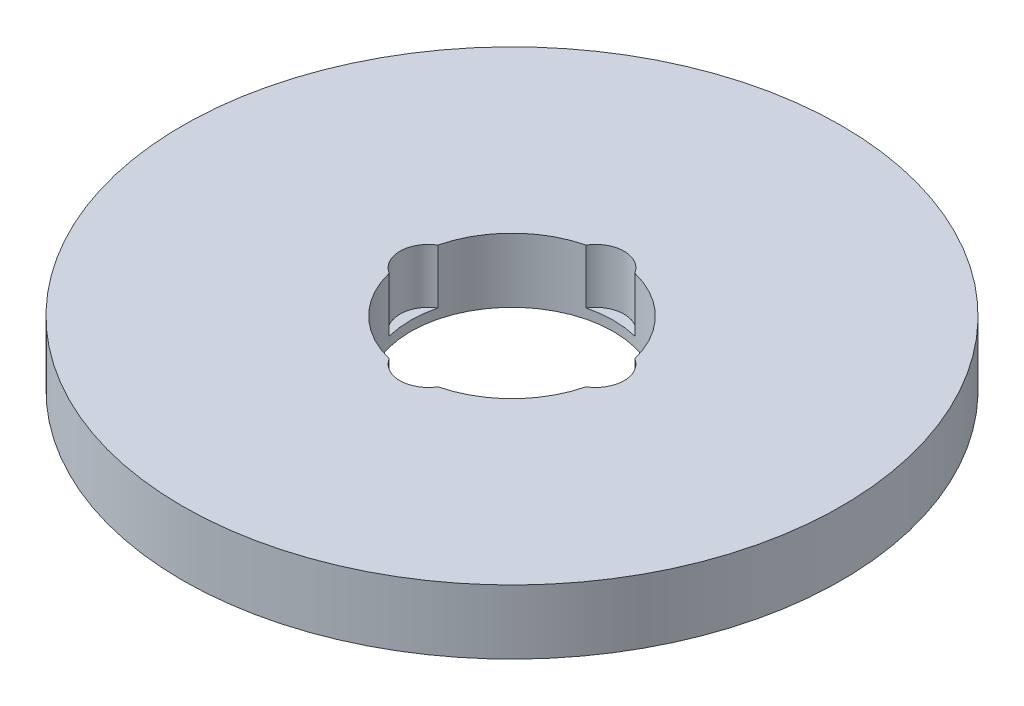
ISO-10303-21;
HEADER;
FILE_DESCRIPTION(('STEP AP214'),'2;1');
FILE_NAME('part.step','',(''),(''),'','','');
FILE_SCHEMA(('AUTOMOTIVE_DESIGN { 1 0 10303 214 1 1 1 1 }'));
ENDSEC;
DATA;
#1=APPLICATION_CONTEXT('core data for automotive mechanical design processes');
#2=APPLICATION_PROTOCOL_DEFINITION('international standard','automotive_design',2000,#1);
#3=PRODUCT_CONTEXT('',#1,'mechanical');
#4=PRODUCT('Part','Part','',(#3));
#5=PRODUCT_RELATED_PRODUCT_CATEGORY('part','',(#4));
#6=PRODUCT_DEFINITION_FORMATION('','',#4);
#7=PRODUCT_DEFINITION_CONTEXT('part definition',#1,'design');
#8=PRODUCT_DEFINITION('design','',#6,#7);
#9=PRODUCT_DEFINITION_SHAPE('','',#8);
#10=(LENGTH_UNIT() NAMED_UNIT(*) SI_UNIT(.MILLI.,.METRE.));
#11=(NAMED_UNIT(*) PLANE_ANGLE_UNIT() SI_UNIT($,.RADIAN.));
#12=(NAMED_UNIT(*) SI_UNIT($,.STERADIAN.) SOLID_ANGLE_UNIT());
#13=UNCERTAINTY_MEASURE_WITH_UNIT(LENGTH_MEASURE(1.E-05),#10,'distance_accuracy_value','');
#14=(GEOMETRIC_REPRESENTATION_CONTEXT(3) GLOBAL_UNCERTAINTY_ASSIGNED_CONTEXT((#13)) GLOBAL_UNIT_ASSIGNED_CONTEXT((#10,
#11,#12)) REPRESENTATION_CONTEXT('',''));
#15=CARTESIAN_POINT('',(0.,0.,0.));
#16=DIRECTION('',(0.,0.,1.));
#17=DIRECTION('',(1.,0.,0.));
#18=AXIS2_PLACEMENT_3D('',#15,#16,#17);
#19=CARTESIAN_POINT('',(0.,19.,0.));
#20=DIRECTION('',(0.,-1.,0.));
#21=DIRECTION('',(0.,0.,-1.));
#22=AXIS2_PLACEMENT_3D('',#19,#20,#21);
#23=CYLINDRICAL_SURFACE('',#22,97.5);
#24=CARTESIAN_POINT('',(0.,19.,0.));
#25=DIRECTION('',(0.,1.,0.));
#26=DIRECTION('',(0.,0.,1.));
#27=AXIS2_PLACEMENT_3D('',#24,#25,#26);
#28=CIRCLE('',#27,97.5);
#29=CARTESIAN_POINT('',(0.,19.,97.5));
#30=VERTEX_POINT('',#29);
#31=EDGE_CURVE('E148',#30,#30,#28,.T.);
#32=ORIENTED_EDGE('',*,*,#31,.F.);
#33=EDGE_LOOP('',(#32));
#34=FACE_BOUND('',#33,.T.);
#35=CARTESIAN_POINT('',(0.,0.,0.));
#36=DIRECTION('',(0.,1.,0.));
#37=DIRECTION('',(0.,0.,1.));
#38=AXIS2_PLACEMENT_3D('',#35,#36,#37);
#39=CIRCLE('',#38,97.5);
#40=CARTESIAN_POINT('',(0.,0.,97.5));
#41=VERTEX_POINT('',#40);
#42=EDGE_CURVE('E139',#41,#41,#39,.T.);
#43=ORIENTED_EDGE('',*,*,#42,.T.);
#44=EDGE_LOOP('',(#43));
#45=FACE_BOUND('',#44,.T.);
#46=ADVANCED_FACE('F39',(#34,#45),#23,.T.);
#47=CARTESIAN_POINT('',(0.,19.,0.));
#48=DIRECTION('',(0.,1.,0.));
#49=DIRECTION('',(0.,0.,1.));
#50=AXIS2_PLACEMENT_3D('',#47,#48,#49);
#51=PLANE('',#50);
#52=CARTESIAN_POINT('',(0.,19.,24.7238429751527));
#53=DIRECTION('',(0.,1.,0.));
#54=DIRECTION('',(1.,0.,0.));
#55=AXIS2_PLACEMENT_3D('',#52,#53,#54);
#56=CIRCLE('',#55,8.44103843737079);
#57=CARTESIAN_POINT('',(-7.20465332845952,19.,29.1220358219805));
#58=VERTEX_POINT('',#57);
#59=CARTESIAN_POINT('',(7.20465332845973,19.,29.1220358219805));
#60=VERTEX_POINT('',#59);
#61=EDGE_CURVE('E175',#58,#60,#56,.T.);
#62=ORIENTED_EDGE('',*,*,#61,.F.);
#63=CARTESIAN_POINT('',(0.,19.,0.));
#64=DIRECTION('',(0.,1.,0.));
#65=DIRECTION('',(0.,0.,1.));
#66=AXIS2_PLACEMENT_3D('',#63,#64,#65);
#67=CIRCLE('',#66,30.);
#68=CARTESIAN_POINT('',(-29.1220358219805,19.,7.20465332845963));
#69=VERTEX_POINT('',#68);
#70=EDGE_CURVE('E134',#69,#58,#67,.T.);
#71=ORIENTED_EDGE('',*,*,#70,.F.);
#72=CARTESIAN_POINT('',(-24.7238429751527,19.,0.));
#73=DIRECTION('',(0.,1.,0.));
#74=DIRECTION('',(0.,0.,1.));
#75=AXIS2_PLACEMENT_3D('',#72,#73,#74);
#76=CIRCLE('',#75,8.44103843737079);
#77=CARTESIAN_POINT('',(-29.1220358219805,19.,-7.20465332845963));
#78=VERTEX_POINT('',#77);
#79=EDGE_CURVE('E143',#78,#69,#76,.T.);
#80=ORIENTED_EDGE('',*,*,#79,.F.);
#81=CARTESIAN_POINT('',(-7.20465332845993,19.,-29.1220358219804));
#82=VERTEX_POINT('',#81);
#83=EDGE_CURVE('E123',#82,#78,#67,.T.);
#84=ORIENTED_EDGE('',*,*,#83,.F.);
#85=CARTESIAN_POINT('',(-2.58968509116701E-13,19.,-24.7238429751527));
#86=DIRECTION('',(0.,1.,0.));
#87=DIRECTION('',(-1.,0.,0.));
#88=AXIS2_PLACEMENT_3D('',#85,#86,#87);
#89=CIRCLE('',#88,8.44103843737079);
#90=CARTESIAN_POINT('',(7.20465332845932,19.,-29.1220358219806));
#91=VERTEX_POINT('',#90);
#92=EDGE_CURVE('E106',#91,#82,#89,.T.);
#93=ORIENTED_EDGE('',*,*,#92,.F.);
#94=CARTESIAN_POINT('',(29.1220358219805,19.,-7.20465332845963));
#95=VERTEX_POINT('',#94);
#96=EDGE_CURVE('E125',#95,#91,#67,.T.);
#97=ORIENTED_EDGE('',*,*,#96,.F.);
#98=CARTESIAN_POINT('',(24.7238429751527,19.,0.));
#99=DIRECTION('',(0.,1.,0.));
#100=DIRECTION('',(0.,0.,-1.));
#101=AXIS2_PLACEMENT_3D('',#98,#99,#100);
#102=CIRCLE('',#101,8.44103843737079);
#103=CARTESIAN_POINT('',(29.1220358219805,19.,7.20465332845963));
#104=VERTEX_POINT('',#103);
#105=EDGE_CURVE('E286',#104,#95,#102,.T.);
#106=ORIENTED_EDGE('',*,*,#105,.F.);
#107=EDGE_CURVE('E135',#60,#104,#67,.T.);
#108=ORIENTED_EDGE('',*,*,#107,.F.);
#109=EDGE_LOOP('',(#62,#71,#80,#84,#93,#97,#106,#108));
#110=FACE_BOUND('',#109,.T.);
#111=ORIENTED_EDGE('',*,*,#31,.T.);
#112=EDGE_LOOP('',(#111));
#113=FACE_BOUND('',#112,.T.);
#114=ADVANCED_FACE('F118',(#110,#113),#51,.T.);
#115=CARTESIAN_POINT('',(0.,0.,0.));
#116=DIRECTION('',(0.,1.,0.));
#117=DIRECTION('',(0.,0.,1.));
#118=AXIS2_PLACEMENT_3D('',#115,#116,#117);
#119=PLANE('',#118);
#120=CARTESIAN_POINT('',(0.,0.,0.));
#121=DIRECTION('',(0.,1.,0.));
#122=DIRECTION('',(0.,0.,1.));
#123=AXIS2_PLACEMENT_3D('',#120,#121,#122);
#124=CIRCLE('',#123,30.);
#125=CARTESIAN_POINT('',(0.,0.,30.));
#126=VERTEX_POINT('',#125);
#127=EDGE_CURVE('E136',#126,#126,#124,.T.);
#128=ORIENTED_EDGE('',*,*,#127,.T.);
#129=EDGE_LOOP('',(#128));
#130=FACE_BOUND('',#129,.T.);
#131=ORIENTED_EDGE('',*,*,#42,.F.);
#132=EDGE_LOOP('',(#131));
#133=FACE_BOUND('',#132,.T.);
#134=ADVANCED_FACE('F187',(#130,#133),#119,.F.);
#135=CARTESIAN_POINT('',(0.,19.,0.));
#136=DIRECTION('',(0.,-1.,0.));
#137=DIRECTION('',(0.,0.,-1.));
#138=AXIS2_PLACEMENT_3D('',#135,#136,#137);
#139=CYLINDRICAL_SURFACE('',#138,30.);
#140=DIRECTION('',(0.,1.,0.));
#141=VECTOR('',#140,1.);
#142=CARTESIAN_POINT('',(-7.20465332845952,10.9364369538742,29.1220358219805));
#143=LINE('',#142,#141);
#144=CARTESIAN_POINT('',(-7.20465332845952,2.87287390774831,29.1220358219805));
#145=VERTEX_POINT('',#144);
#146=EDGE_CURVE('E11',#145,#58,#143,.T.);
#147=ORIENTED_EDGE('',*,*,#146,.F.);
#148=CARTESIAN_POINT('',(0.,2.87287390774831,0.));
#149=DIRECTION('',(0.,1.,0.));
#150=DIRECTION('',(0.,0.,1.));
#151=AXIS2_PLACEMENT_3D('',#148,#149,#150);
#152=CIRCLE('',#151,30.);
#153=CARTESIAN_POINT('',(7.20465332845973,2.87287390774831,29.1220358219805));
#154=VERTEX_POINT('',#153);
#155=EDGE_CURVE('E170',#145,#154,#152,.T.);
#156=ORIENTED_EDGE('',*,*,#155,.T.);
#157=DIRECTION('',(0.,1.,0.));
#158=VECTOR('',#157,1.);
#159=CARTESIAN_POINT('',(7.20465332845973,10.9364369538742,29.1220358219805));
#160=LINE('',#159,#158);
#161=EDGE_CURVE('E46',#60,#154,#160,.F.);
#162=ORIENTED_EDGE('',*,*,#161,.F.);
#163=ORIENTED_EDGE('',*,*,#107,.T.);
#164=DIRECTION('',(0.,1.,0.));
#165=VECTOR('',#164,1.);
#166=CARTESIAN_POINT('',(29.1220358219805,10.9364369538742,7.20465332845963));
#167=LINE('',#166,#165);
#168=CARTESIAN_POINT('',(29.1220358219805,2.87287390774831,7.20465332845963));
#169=VERTEX_POINT('',#168);
#170=EDGE_CURVE('E164',#169,#104,#167,.T.);
#171=ORIENTED_EDGE('',*,*,#170,.F.);
#172=CARTESIAN_POINT('',(0.,2.87287390774831,0.));
#173=DIRECTION('',(0.,1.,0.));
#174=DIRECTION('',(0.,0.,1.));
#175=AXIS2_PLACEMENT_3D('',#172,#173,#174);
#176=CIRCLE('',#175,30.);
#177=CARTESIAN_POINT('',(29.1220358219805,2.87287390774831,-7.20465332845963));
#178=VERTEX_POINT('',#177);
#179=EDGE_CURVE('E115',#169,#178,#176,.T.);
#180=ORIENTED_EDGE('',*,*,#179,.T.);
#181=DIRECTION('',(0.,1.,0.));
#182=VECTOR('',#181,1.);
#183=CARTESIAN_POINT('',(29.1220358219805,10.9364369538742,-7.20465332845963));
#184=LINE('',#183,#182);
#185=EDGE_CURVE('E131',#95,#178,#184,.F.);
#186=ORIENTED_EDGE('',*,*,#185,.F.);
#187=ORIENTED_EDGE('',*,*,#96,.T.);
#188=DIRECTION('',(0.,1.,0.));
#189=VECTOR('',#188,1.);
#190=CARTESIAN_POINT('',(7.20465332845932,10.9364369538742,-29.1220358219806));
#191=LINE('',#190,#189);
#192=CARTESIAN_POINT('',(7.20465332845932,2.87287390774831,-29.1220358219806));
#193=VERTEX_POINT('',#192);
#194=EDGE_CURVE('E105',#193,#91,#191,.T.);
#195=ORIENTED_EDGE('',*,*,#194,.F.);
#196=CARTESIAN_POINT('',(0.,2.87287390774831,0.));
#197=DIRECTION('',(0.,1.,0.));
#198=DIRECTION('',(0.,0.,1.));
#199=AXIS2_PLACEMENT_3D('',#196,#197,#198);
#200=CIRCLE('',#199,30.);
#201=CARTESIAN_POINT('',(-7.20465332845993,2.87287390774831,-29.1220358219804));
#202=VERTEX_POINT('',#201);
#203=EDGE_CURVE('E159',#193,#202,#200,.T.);
#204=ORIENTED_EDGE('',*,*,#203,.T.);
#205=DIRECTION('',(0.,1.,0.));
#206=VECTOR('',#205,1.);
#207=CARTESIAN_POINT('',(-7.20465332845993,10.9364369538742,-29.1220358219804));
#208=LINE('',#207,#206);
#209=EDGE_CURVE('E114',#82,#202,#208,.F.);
#210=ORIENTED_EDGE('',*,*,#209,.F.);
#211=ORIENTED_EDGE('',*,*,#83,.T.);
#212=DIRECTION('',(0.,1.,0.));
#213=VECTOR('',#212,1.);
#214=CARTESIAN_POINT('',(-29.1220358219805,10.9364369538742,-7.20465332845963));
#215=LINE('',#214,#213);
#216=CARTESIAN_POINT('',(-29.1220358219805,2.87287390774831,-7.20465332845963));
#217=VERTEX_POINT('',#216);
#218=EDGE_CURVE('E160',#217,#78,#215,.T.);
#219=ORIENTED_EDGE('',*,*,#218,.F.);
#220=CARTESIAN_POINT('',(0.,2.87287390774831,0.));
#221=DIRECTION('',(0.,1.,0.));
#222=DIRECTION('',(0.,0.,1.));
#223=AXIS2_PLACEMENT_3D('',#220,#221,#222);
#224=CIRCLE('',#223,30.);
#225=CARTESIAN_POINT('',(-29.1220358219805,2.87287390774831,7.20465332845963));
#226=VERTEX_POINT('',#225);
#227=EDGE_CURVE('E149',#217,#226,#224,.T.);
#228=ORIENTED_EDGE('',*,*,#227,.T.);
#229=DIRECTION('',(0.,1.,0.));
#230=VECTOR('',#229,1.);
#231=CARTESIAN_POINT('',(-29.1220358219805,10.9364369538742,7.20465332845963));
#232=LINE('',#231,#230);
#233=EDGE_CURVE('E152',#69,#226,#232,.F.);
#234=ORIENTED_EDGE('',*,*,#233,.F.);
#235=ORIENTED_EDGE('',*,*,#70,.T.);
#236=EDGE_LOOP('',(#147,#156,#162,#163,#171,#180,#186,#187,#195,#204,#210,#211,#219,#228,#234,#235));
#237=FACE_BOUND('',#236,.T.);
#238=ORIENTED_EDGE('',*,*,#127,.F.);
#239=EDGE_LOOP('',(#238));
#240=FACE_BOUND('',#239,.T.);
#241=ADVANCED_FACE('F126',(#237,#240),#139,.F.);
#242=CARTESIAN_POINT('',(-24.7238429751527,2.87287390774831,0.));
#243=DIRECTION('',(0.,1.,0.));
#244=DIRECTION('',(0.,0.,1.));
#245=AXIS2_PLACEMENT_3D('',#242,#243,#244);
#246=CYLINDRICAL_SURFACE('',#245,8.44103843737079);
#247=ORIENTED_EDGE('',*,*,#218,.T.);
#248=ORIENTED_EDGE('',*,*,#79,.T.);
#249=ORIENTED_EDGE('',*,*,#233,.T.);
#250=CARTESIAN_POINT('',(-24.7238429751527,2.87287390774831,0.));
#251=DIRECTION('',(0.,1.,0.));
#252=DIRECTION('',(0.,0.,1.));
#253=AXIS2_PLACEMENT_3D('',#250,#251,#252);
#254=CIRCLE('',#253,8.44103843737079);
#255=EDGE_CURVE('E144',#217,#226,#254,.T.);
#256=ORIENTED_EDGE('',*,*,#255,.F.);
#257=EDGE_LOOP('',(#247,#248,#249,#256));
#258=FACE_BOUND('',#257,.T.);
#259=ADVANCED_FACE('F200',(#258),#246,.F.);
#260=CARTESIAN_POINT('',(-24.7238429751527,2.87287390774831,0.));
#261=DIRECTION('',(0.,1.,0.));
#262=DIRECTION('',(0.,0.,1.));
#263=AXIS2_PLACEMENT_3D('',#260,#261,#262);
#264=PLANE('',#263);
#265=ORIENTED_EDGE('',*,*,#255,.T.);
#266=ORIENTED_EDGE('',*,*,#227,.F.);
#267=EDGE_LOOP('',(#265,#266));
#268=FACE_BOUND('',#267,.T.);
#269=ADVANCED_FACE('F201',(#268),#264,.T.);
#270=CARTESIAN_POINT('',(-2.58968509116701E-13,2.87287390774831,-24.7238429751527));
#271=DIRECTION('',(0.,1.,0.));
#272=DIRECTION('',(0.,0.,1.));
#273=AXIS2_PLACEMENT_3D('',#270,#271,#272);
#274=CYLINDRICAL_SURFACE('',#273,8.44103843737079);
#275=ORIENTED_EDGE('',*,*,#194,.T.);
#276=ORIENTED_EDGE('',*,*,#92,.T.);
#277=ORIENTED_EDGE('',*,*,#209,.T.);
#278=CARTESIAN_POINT('',(-2.58968509116701E-13,2.87287390774831,-24.7238429751527));
#279=DIRECTION('',(0.,1.,0.));
#280=DIRECTION('',(-1.,0.,0.));
#281=AXIS2_PLACEMENT_3D('',#278,#279,#280);
#282=CIRCLE('',#281,8.44103843737079);
#283=EDGE_CURVE('E107',#193,#202,#282,.T.);
#284=ORIENTED_EDGE('',*,*,#283,.F.);
#285=EDGE_LOOP('',(#275,#276,#277,#284));
#286=FACE_BOUND('',#285,.T.);
#287=ADVANCED_FACE('F102',(#286),#274,.F.);
#288=CARTESIAN_POINT('',(-2.58968509116701E-13,2.87287390774831,-24.7238429751527));
#289=DIRECTION('',(0.,1.,0.));
#290=DIRECTION('',(-1.,0.,0.));
#291=AXIS2_PLACEMENT_3D('',#288,#289,#290);
#292=PLANE('',#291);
#293=ORIENTED_EDGE('',*,*,#283,.T.);
#294=ORIENTED_EDGE('',*,*,#203,.F.);
#295=EDGE_LOOP('',(#293,#294));
#296=FACE_BOUND('',#295,.T.);
#297=ADVANCED_FACE('F209',(#296),#292,.T.);
#298=CARTESIAN_POINT('',(24.7238429751527,2.87287390774831,0.));
#299=DIRECTION('',(0.,1.,0.));
#300=DIRECTION('',(0.,0.,1.));
#301=AXIS2_PLACEMENT_3D('',#298,#299,#300);
#302=CYLINDRICAL_SURFACE('',#301,8.44103843737079);
#303=ORIENTED_EDGE('',*,*,#170,.T.);
#304=ORIENTED_EDGE('',*,*,#105,.T.);
#305=ORIENTED_EDGE('',*,*,#185,.T.);
#306=CARTESIAN_POINT('',(24.7238429751527,2.87287390774831,0.));
#307=DIRECTION('',(0.,1.,0.));
#308=DIRECTION('',(0.,0.,-1.));
#309=AXIS2_PLACEMENT_3D('',#306,#307,#308);
#310=CIRCLE('',#309,8.44103843737079);
#311=EDGE_CURVE('E56',#169,#178,#310,.T.);
#312=ORIENTED_EDGE('',*,*,#311,.F.);
#313=EDGE_LOOP('',(#303,#304,#305,#312));
#314=FACE_BOUND('',#313,.T.);
#315=ADVANCED_FACE('F213',(#314),#302,.F.);
#316=CARTESIAN_POINT('',(24.7238429751527,2.87287390774831,0.));
#317=DIRECTION('',(0.,1.,0.));
#318=DIRECTION('',(0.,0.,-1.));
#319=AXIS2_PLACEMENT_3D('',#316,#317,#318);
#320=PLANE('',#319);
#321=ORIENTED_EDGE('',*,*,#311,.T.);
#322=ORIENTED_EDGE('',*,*,#179,.F.);
#323=EDGE_LOOP('',(#321,#322));
#324=FACE_BOUND('',#323,.T.);
#325=ADVANCED_FACE('F179',(#324),#320,.T.);
#326=CARTESIAN_POINT('',(0.,2.87287390774831,24.7238429751527));
#327=DIRECTION('',(0.,1.,0.));
#328=DIRECTION('',(0.,0.,1.));
#329=AXIS2_PLACEMENT_3D('',#326,#327,#328);
#330=CYLINDRICAL_SURFACE('',#329,8.44103843737079);
#331=ORIENTED_EDGE('',*,*,#146,.T.);
#332=ORIENTED_EDGE('',*,*,#61,.T.);
#333=ORIENTED_EDGE('',*,*,#161,.T.);
#334=CARTESIAN_POINT('',(0.,2.87287390774831,24.7238429751527));
#335=DIRECTION('',(0.,1.,0.));
#336=DIRECTION('',(1.,0.,0.));
#337=AXIS2_PLACEMENT_3D('',#334,#335,#336);
#338=CIRCLE('',#337,8.44103843737079);
#339=EDGE_CURVE('E55',#145,#154,#338,.T.);
#340=ORIENTED_EDGE('',*,*,#339,.F.);
#341=EDGE_LOOP('',(#331,#332,#333,#340));
#342=FACE_BOUND('',#341,.T.);
#343=ADVANCED_FACE('F171',(#342),#330,.F.);
#344=CARTESIAN_POINT('',(0.,2.87287390774831,24.7238429751527));
#345=DIRECTION('',(0.,1.,0.));
#346=DIRECTION('',(1.,0.,0.));
#347=AXIS2_PLACEMENT_3D('',#344,#345,#346);
#348=PLANE('',#347);
#349=ORIENTED_EDGE('',*,*,#339,.T.);
#350=ORIENTED_EDGE('',*,*,#155,.F.);
#351=EDGE_LOOP('',(#349,#350));
#352=FACE_BOUND('',#351,.T.);
#353=ADVANCED_FACE('F173',(#352),#348,.T.);
#354=CLOSED_SHELL('',(#46,#114,#134,#241,#259,#269,#287,#297,#315,#325,#343,#353));
#355=MANIFOLD_SOLID_BREP('B2',#354);
#356=ADVANCED_BREP_SHAPE_REPRESENTATION('',(#18,#355),#14);
#357=SHAPE_DEFINITION_REPRESENTATION(#9,#356);
ENDSEC;
END-ISO-10303-21;
